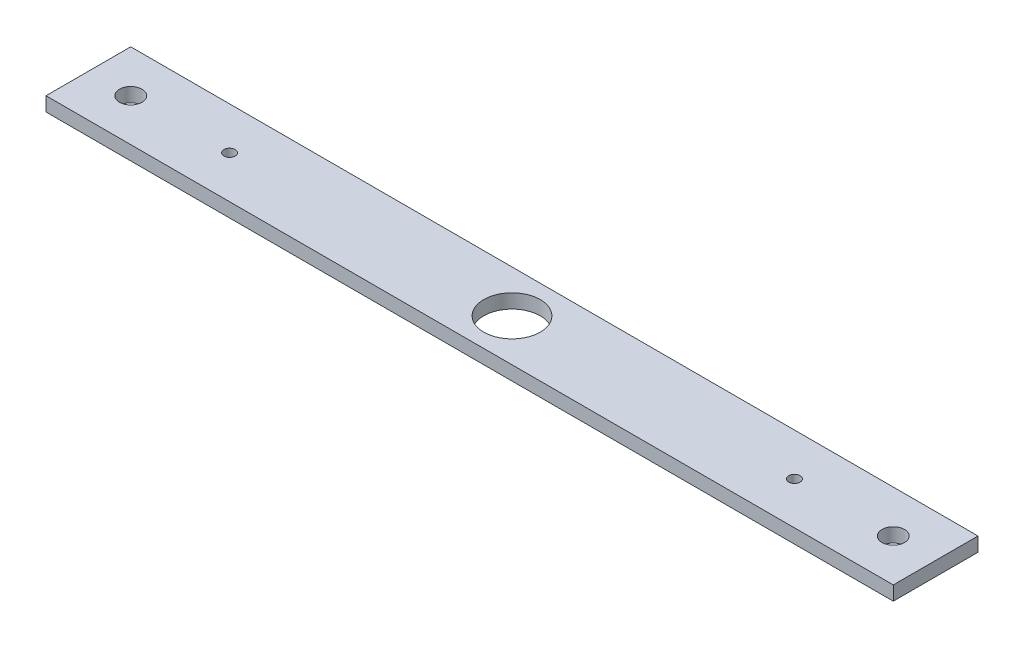
ISO-10303-21;
HEADER;
FILE_DESCRIPTION(('STEP AP214'),'2;1');
FILE_NAME('part.step','',(''),(''),'','','');
FILE_SCHEMA(('AUTOMOTIVE_DESIGN { 1 0 10303 214 1 1 1 1 }'));
ENDSEC;
DATA;
#1=APPLICATION_CONTEXT('core data for automotive mechanical design processes');
#2=APPLICATION_PROTOCOL_DEFINITION('international standard','automotive_design',2000,#1);
#3=PRODUCT_CONTEXT('',#1,'mechanical');
#4=PRODUCT('Part','Part','',(#3));
#5=PRODUCT_RELATED_PRODUCT_CATEGORY('part','',(#4));
#6=PRODUCT_DEFINITION_FORMATION('','',#4);
#7=PRODUCT_DEFINITION_CONTEXT('part definition',#1,'design');
#8=PRODUCT_DEFINITION('design','',#6,#7);
#9=PRODUCT_DEFINITION_SHAPE('','',#8);
#10=(LENGTH_UNIT() NAMED_UNIT(*) SI_UNIT(.MILLI.,.METRE.));
#11=(NAMED_UNIT(*) PLANE_ANGLE_UNIT() SI_UNIT($,.RADIAN.));
#12=(NAMED_UNIT(*) SI_UNIT($,.STERADIAN.) SOLID_ANGLE_UNIT());
#13=UNCERTAINTY_MEASURE_WITH_UNIT(LENGTH_MEASURE(1.E-05),#10,'distance_accuracy_value','');
#14=(GEOMETRIC_REPRESENTATION_CONTEXT(3) GLOBAL_UNCERTAINTY_ASSIGNED_CONTEXT((#13)) GLOBAL_UNIT_ASSIGNED_CONTEXT((#10,
#11,#12)) REPRESENTATION_CONTEXT('',''));
#15=CARTESIAN_POINT('',(0.,0.,0.));
#16=DIRECTION('',(0.,0.,1.));
#17=DIRECTION('',(1.,0.,0.));
#18=AXIS2_PLACEMENT_3D('',#15,#16,#17);
#19=CARTESIAN_POINT('',(150.,5.,15.));
#20=DIRECTION('',(-1.,0.,0.));
#21=DIRECTION('',(0.,0.,1.));
#22=AXIS2_PLACEMENT_3D('',#19,#20,#21);
#23=PLANE('',#22);
#24=DIRECTION('',(0.,0.,-1.));
#25=VECTOR('',#24,1.);
#26=CARTESIAN_POINT('',(150.,0.,15.));
#27=LINE('',#26,#25);
#28=CARTESIAN_POINT('',(150.,0.,15.));
#29=VERTEX_POINT('',#28);
#30=CARTESIAN_POINT('',(150.,0.,-15.));
#31=VERTEX_POINT('',#30);
#32=EDGE_CURVE('E96',#29,#31,#27,.T.);
#33=ORIENTED_EDGE('',*,*,#32,.T.);
#34=DIRECTION('',(0.,-1.,0.));
#35=VECTOR('',#34,1.);
#36=CARTESIAN_POINT('',(150.,5.,-15.));
#37=LINE('',#36,#35);
#38=CARTESIAN_POINT('',(150.,5.,-15.));
#39=VERTEX_POINT('',#38);
#40=EDGE_CURVE('E11',#39,#31,#37,.T.);
#41=ORIENTED_EDGE('',*,*,#40,.F.);
#42=DIRECTION('',(0.,0.,-1.));
#43=VECTOR('',#42,1.);
#44=CARTESIAN_POINT('',(150.,5.,15.));
#45=LINE('',#44,#43);
#46=CARTESIAN_POINT('',(150.,5.,15.));
#47=VERTEX_POINT('',#46);
#48=EDGE_CURVE('E84',#47,#39,#45,.T.);
#49=ORIENTED_EDGE('',*,*,#48,.F.);
#50=DIRECTION('',(0.,-1.,0.));
#51=VECTOR('',#50,1.);
#52=CARTESIAN_POINT('',(150.,5.,15.));
#53=LINE('',#52,#51);
#54=EDGE_CURVE('E92',#47,#29,#53,.T.);
#55=ORIENTED_EDGE('',*,*,#54,.T.);
#56=EDGE_LOOP('',(#33,#41,#49,#55));
#57=FACE_BOUND('',#56,.T.);
#58=ADVANCED_FACE('F33',(#57),#23,.F.);
#59=CARTESIAN_POINT('',(-150.,5.,-15.));
#60=DIRECTION('',(0.,0.,1.));
#61=DIRECTION('',(1.,0.,0.));
#62=AXIS2_PLACEMENT_3D('',#59,#60,#61);
#63=PLANE('',#62);
#64=DIRECTION('',(-1.,0.,0.));
#65=VECTOR('',#64,1.);
#66=CARTESIAN_POINT('',(-150.,0.,-15.));
#67=LINE('',#66,#65);
#68=CARTESIAN_POINT('',(-150.,0.,-15.));
#69=VERTEX_POINT('',#68);
#70=EDGE_CURVE('E88',#31,#69,#67,.T.);
#71=ORIENTED_EDGE('',*,*,#70,.T.);
#72=DIRECTION('',(0.,-1.,0.));
#73=VECTOR('',#72,1.);
#74=CARTESIAN_POINT('',(-150.,5.,-15.));
#75=LINE('',#74,#73);
#76=CARTESIAN_POINT('',(-150.,5.,-15.));
#77=VERTEX_POINT('',#76);
#78=EDGE_CURVE('E41',#77,#69,#75,.T.);
#79=ORIENTED_EDGE('',*,*,#78,.F.);
#80=DIRECTION('',(-1.,0.,0.));
#81=VECTOR('',#80,1.);
#82=CARTESIAN_POINT('',(-150.,5.,-15.));
#83=LINE('',#82,#81);
#84=EDGE_CURVE('E79',#39,#77,#83,.T.);
#85=ORIENTED_EDGE('',*,*,#84,.F.);
#86=ORIENTED_EDGE('',*,*,#40,.T.);
#87=EDGE_LOOP('',(#71,#79,#85,#86));
#88=FACE_BOUND('',#87,.T.);
#89=ADVANCED_FACE('F87',(#88),#63,.F.);
#90=CARTESIAN_POINT('',(-150.,5.,15.));
#91=DIRECTION('',(1.,0.,0.));
#92=DIRECTION('',(0.,0.,-1.));
#93=AXIS2_PLACEMENT_3D('',#90,#91,#92);
#94=PLANE('',#93);
#95=DIRECTION('',(0.,0.,1.));
#96=VECTOR('',#95,1.);
#97=CARTESIAN_POINT('',(-150.,0.,15.));
#98=LINE('',#97,#96);
#99=CARTESIAN_POINT('',(-150.,0.,15.));
#100=VERTEX_POINT('',#99);
#101=EDGE_CURVE('E66',#69,#100,#98,.T.);
#102=ORIENTED_EDGE('',*,*,#101,.T.);
#103=DIRECTION('',(0.,-1.,0.));
#104=VECTOR('',#103,1.);
#105=CARTESIAN_POINT('',(-150.,5.,15.));
#106=LINE('',#105,#104);
#107=CARTESIAN_POINT('',(-150.,5.,15.));
#108=VERTEX_POINT('',#107);
#109=EDGE_CURVE('E89',#108,#100,#106,.T.);
#110=ORIENTED_EDGE('',*,*,#109,.F.);
#111=DIRECTION('',(0.,0.,1.));
#112=VECTOR('',#111,1.);
#113=CARTESIAN_POINT('',(-150.,5.,15.));
#114=LINE('',#113,#112);
#115=EDGE_CURVE('E82',#77,#108,#114,.T.);
#116=ORIENTED_EDGE('',*,*,#115,.F.);
#117=ORIENTED_EDGE('',*,*,#78,.T.);
#118=EDGE_LOOP('',(#102,#110,#116,#117));
#119=FACE_BOUND('',#118,.T.);
#120=ADVANCED_FACE('F90',(#119),#94,.F.);
#121=CARTESIAN_POINT('',(-150.,5.,15.));
#122=DIRECTION('',(0.,0.,-1.));
#123=DIRECTION('',(-1.,0.,0.));
#124=AXIS2_PLACEMENT_3D('',#121,#122,#123);
#125=PLANE('',#124);
#126=DIRECTION('',(1.,0.,0.));
#127=VECTOR('',#126,1.);
#128=CARTESIAN_POINT('',(-150.,0.,15.));
#129=LINE('',#128,#127);
#130=EDGE_CURVE('E72',#100,#29,#129,.T.);
#131=ORIENTED_EDGE('',*,*,#130,.T.);
#132=ORIENTED_EDGE('',*,*,#54,.F.);
#133=DIRECTION('',(1.,0.,0.));
#134=VECTOR('',#133,1.);
#135=CARTESIAN_POINT('',(-150.,5.,15.));
#136=LINE('',#135,#134);
#137=EDGE_CURVE('E49',#108,#47,#136,.T.);
#138=ORIENTED_EDGE('',*,*,#137,.F.);
#139=ORIENTED_EDGE('',*,*,#109,.T.);
#140=EDGE_LOOP('',(#131,#132,#138,#139));
#141=FACE_BOUND('',#140,.T.);
#142=ADVANCED_FACE('F104',(#141),#125,.F.);
#143=CARTESIAN_POINT('',(0.,5.,0.));
#144=DIRECTION('',(0.,-1.,0.));
#145=DIRECTION('',(0.,0.,-1.));
#146=AXIS2_PLACEMENT_3D('',#143,#144,#145);
#147=PLANE('',#146);
#148=CARTESIAN_POINT('',(100.,5.,0.));
#149=DIRECTION('',(0.,1.,0.));
#150=DIRECTION('',(0.,0.,1.));
#151=AXIS2_PLACEMENT_3D('',#148,#149,#150);
#152=CIRCLE('',#151,1.99999999999998);
#153=CARTESIAN_POINT('',(100.,5.,1.99999999999998));
#154=VERTEX_POINT('',#153);
#155=EDGE_CURVE('E134',#154,#154,#152,.T.);
#156=ORIENTED_EDGE('',*,*,#155,.F.);
#157=EDGE_LOOP('',(#156));
#158=FACE_BOUND('',#157,.T.);
#159=CARTESIAN_POINT('',(-100.,5.,0.));
#160=DIRECTION('',(0.,1.,0.));
#161=DIRECTION('',(0.,0.,1.));
#162=AXIS2_PLACEMENT_3D('',#159,#160,#161);
#163=CIRCLE('',#162,2.);
#164=CARTESIAN_POINT('',(-100.,5.,2.));
#165=VERTEX_POINT('',#164);
#166=EDGE_CURVE('E128',#165,#165,#163,.T.);
#167=ORIENTED_EDGE('',*,*,#166,.F.);
#168=EDGE_LOOP('',(#167));
#169=FACE_BOUND('',#168,.T.);
#170=CARTESIAN_POINT('',(-135.,5.,0.));
#171=DIRECTION('',(0.,1.,0.));
#172=DIRECTION('',(0.,0.,1.));
#173=AXIS2_PLACEMENT_3D('',#170,#171,#172);
#174=CIRCLE('',#173,3.99999999999999);
#175=CARTESIAN_POINT('',(-135.,5.,3.99999999999999));
#176=VERTEX_POINT('',#175);
#177=EDGE_CURVE('E123',#176,#176,#174,.T.);
#178=ORIENTED_EDGE('',*,*,#177,.F.);
#179=EDGE_LOOP('',(#178));
#180=FACE_BOUND('',#179,.T.);
#181=CARTESIAN_POINT('',(0.,5.,0.));
#182=DIRECTION('',(0.,1.,0.));
#183=DIRECTION('',(0.,0.,1.));
#184=AXIS2_PLACEMENT_3D('',#181,#182,#183);
#185=CIRCLE('',#184,10.);
#186=CARTESIAN_POINT('',(0.,5.,10.));
#187=VERTEX_POINT('',#186);
#188=EDGE_CURVE('E117',#187,#187,#185,.T.);
#189=ORIENTED_EDGE('',*,*,#188,.F.);
#190=EDGE_LOOP('',(#189));
#191=FACE_BOUND('',#190,.T.);
#192=CARTESIAN_POINT('',(135.,5.,0.));
#193=DIRECTION('',(0.,1.,0.));
#194=DIRECTION('',(0.,0.,1.));
#195=AXIS2_PLACEMENT_3D('',#192,#193,#194);
#196=CIRCLE('',#195,3.99999999999999);
#197=CARTESIAN_POINT('',(135.,5.,3.99999999999999));
#198=VERTEX_POINT('',#197);
#199=EDGE_CURVE('E110',#198,#198,#196,.T.);
#200=ORIENTED_EDGE('',*,*,#199,.F.);
#201=EDGE_LOOP('',(#200));
#202=FACE_BOUND('',#201,.T.);
#203=ORIENTED_EDGE('',*,*,#48,.T.);
#204=ORIENTED_EDGE('',*,*,#84,.T.);
#205=ORIENTED_EDGE('',*,*,#115,.T.);
#206=ORIENTED_EDGE('',*,*,#137,.T.);
#207=EDGE_LOOP('',(#203,#204,#205,#206));
#208=FACE_BOUND('',#207,.T.);
#209=ADVANCED_FACE('F80',(#158,#169,#180,#191,#202,#208),#147,.F.);
#210=CARTESIAN_POINT('',(0.,0.,0.));
#211=DIRECTION('',(0.,-1.,0.));
#212=DIRECTION('',(0.,0.,-1.));
#213=AXIS2_PLACEMENT_3D('',#210,#211,#212);
#214=PLANE('',#213);
#215=CARTESIAN_POINT('',(100.,0.,0.));
#216=DIRECTION('',(0.,1.,0.));
#217=DIRECTION('',(0.,0.,1.));
#218=AXIS2_PLACEMENT_3D('',#215,#216,#217);
#219=CIRCLE('',#218,1.99999999999998);
#220=CARTESIAN_POINT('',(100.,0.,1.99999999999998));
#221=VERTEX_POINT('',#220);
#222=EDGE_CURVE('E114',#221,#221,#219,.T.);
#223=ORIENTED_EDGE('',*,*,#222,.T.);
#224=EDGE_LOOP('',(#223));
#225=FACE_BOUND('',#224,.T.);
#226=CARTESIAN_POINT('',(-100.,0.,0.));
#227=DIRECTION('',(0.,1.,0.));
#228=DIRECTION('',(0.,0.,1.));
#229=AXIS2_PLACEMENT_3D('',#226,#227,#228);
#230=CIRCLE('',#229,2.);
#231=CARTESIAN_POINT('',(-100.,0.,2.));
#232=VERTEX_POINT('',#231);
#233=EDGE_CURVE('E131',#232,#232,#230,.T.);
#234=ORIENTED_EDGE('',*,*,#233,.T.);
#235=EDGE_LOOP('',(#234));
#236=FACE_BOUND('',#235,.T.);
#237=CARTESIAN_POINT('',(-135.,0.,0.));
#238=DIRECTION('',(0.,1.,0.));
#239=DIRECTION('',(0.,0.,1.));
#240=AXIS2_PLACEMENT_3D('',#237,#238,#239);
#241=CIRCLE('',#240,3.99999999999999);
#242=CARTESIAN_POINT('',(-135.,0.,3.99999999999999));
#243=VERTEX_POINT('',#242);
#244=EDGE_CURVE('E99',#243,#243,#241,.T.);
#245=ORIENTED_EDGE('',*,*,#244,.T.);
#246=EDGE_LOOP('',(#245));
#247=FACE_BOUND('',#246,.T.);
#248=CARTESIAN_POINT('',(0.,0.,0.));
#249=DIRECTION('',(0.,1.,0.));
#250=DIRECTION('',(0.,0.,1.));
#251=AXIS2_PLACEMENT_3D('',#248,#249,#250);
#252=CIRCLE('',#251,10.);
#253=CARTESIAN_POINT('',(0.,0.,10.));
#254=VERTEX_POINT('',#253);
#255=EDGE_CURVE('E120',#254,#254,#252,.T.);
#256=ORIENTED_EDGE('',*,*,#255,.T.);
#257=EDGE_LOOP('',(#256));
#258=FACE_BOUND('',#257,.T.);
#259=CARTESIAN_POINT('',(135.,0.,0.));
#260=DIRECTION('',(0.,1.,0.));
#261=DIRECTION('',(0.,0.,1.));
#262=AXIS2_PLACEMENT_3D('',#259,#260,#261);
#263=CIRCLE('',#262,3.99999999999999);
#264=CARTESIAN_POINT('',(135.,0.,3.99999999999999));
#265=VERTEX_POINT('',#264);
#266=EDGE_CURVE('E113',#265,#265,#263,.T.);
#267=ORIENTED_EDGE('',*,*,#266,.T.);
#268=EDGE_LOOP('',(#267));
#269=FACE_BOUND('',#268,.T.);
#270=ORIENTED_EDGE('',*,*,#32,.F.);
#271=ORIENTED_EDGE('',*,*,#130,.F.);
#272=ORIENTED_EDGE('',*,*,#101,.F.);
#273=ORIENTED_EDGE('',*,*,#70,.F.);
#274=EDGE_LOOP('',(#270,#271,#272,#273));
#275=FACE_BOUND('',#274,.T.);
#276=ADVANCED_FACE('F107',(#225,#236,#247,#258,#269,#275),#214,.T.);
#277=CARTESIAN_POINT('',(135.,0.,0.));
#278=DIRECTION('',(0.,1.,0.));
#279=DIRECTION('',(0.,0.,1.));
#280=AXIS2_PLACEMENT_3D('',#277,#278,#279);
#281=CYLINDRICAL_SURFACE('',#280,3.99999999999999);
#282=ORIENTED_EDGE('',*,*,#266,.F.);
#283=EDGE_LOOP('',(#282));
#284=FACE_BOUND('',#283,.T.);
#285=ORIENTED_EDGE('',*,*,#199,.T.);
#286=EDGE_LOOP('',(#285));
#287=FACE_BOUND('',#286,.T.);
#288=ADVANCED_FACE('F160',(#284,#287),#281,.F.);
#289=CARTESIAN_POINT('',(0.,0.,0.));
#290=DIRECTION('',(0.,1.,0.));
#291=DIRECTION('',(0.,0.,1.));
#292=AXIS2_PLACEMENT_3D('',#289,#290,#291);
#293=CYLINDRICAL_SURFACE('',#292,10.);
#294=ORIENTED_EDGE('',*,*,#255,.F.);
#295=EDGE_LOOP('',(#294));
#296=FACE_BOUND('',#295,.T.);
#297=ORIENTED_EDGE('',*,*,#188,.T.);
#298=EDGE_LOOP('',(#297));
#299=FACE_BOUND('',#298,.T.);
#300=ADVANCED_FACE('F162',(#296,#299),#293,.F.);
#301=CARTESIAN_POINT('',(-135.,0.,0.));
#302=DIRECTION('',(0.,1.,0.));
#303=DIRECTION('',(0.,0.,1.));
#304=AXIS2_PLACEMENT_3D('',#301,#302,#303);
#305=CYLINDRICAL_SURFACE('',#304,3.99999999999999);
#306=ORIENTED_EDGE('',*,*,#244,.F.);
#307=EDGE_LOOP('',(#306));
#308=FACE_BOUND('',#307,.T.);
#309=ORIENTED_EDGE('',*,*,#177,.T.);
#310=EDGE_LOOP('',(#309));
#311=FACE_BOUND('',#310,.T.);
#312=ADVANCED_FACE('F169',(#308,#311),#305,.F.);
#313=CARTESIAN_POINT('',(-100.,0.,0.));
#314=DIRECTION('',(0.,1.,0.));
#315=DIRECTION('',(0.,0.,1.));
#316=AXIS2_PLACEMENT_3D('',#313,#314,#315);
#317=CYLINDRICAL_SURFACE('',#316,2.);
#318=ORIENTED_EDGE('',*,*,#233,.F.);
#319=EDGE_LOOP('',(#318));
#320=FACE_BOUND('',#319,.T.);
#321=ORIENTED_EDGE('',*,*,#166,.T.);
#322=EDGE_LOOP('',(#321));
#323=FACE_BOUND('',#322,.T.);
#324=ADVANCED_FACE('F145',(#320,#323),#317,.F.);
#325=CARTESIAN_POINT('',(100.,0.,0.));
#326=DIRECTION('',(0.,1.,0.));
#327=DIRECTION('',(0.,0.,1.));
#328=AXIS2_PLACEMENT_3D('',#325,#326,#327);
#329=CYLINDRICAL_SURFACE('',#328,1.99999999999998);
#330=ORIENTED_EDGE('',*,*,#222,.F.);
#331=EDGE_LOOP('',(#330));
#332=FACE_BOUND('',#331,.T.);
#333=ORIENTED_EDGE('',*,*,#155,.T.);
#334=EDGE_LOOP('',(#333));
#335=FACE_BOUND('',#334,.T.);
#336=ADVANCED_FACE('F142',(#332,#335),#329,.F.);
#337=CLOSED_SHELL('',(#58,#89,#120,#142,#209,#276,#288,#300,#312,#324,#336));
#338=MANIFOLD_SOLID_BREP('B2',#337);
#339=ADVANCED_BREP_SHAPE_REPRESENTATION('',(#18,#338),#14);
#340=SHAPE_DEFINITION_REPRESENTATION(#9,#339);
ENDSEC;
END-ISO-10303-21;
